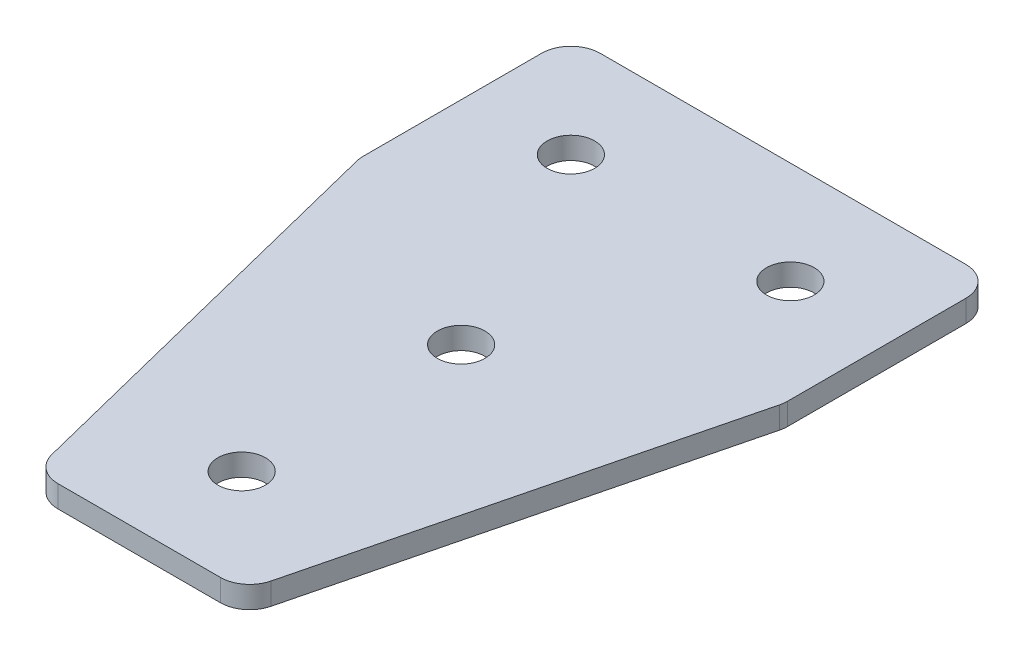
ISO-10303-21;
HEADER;
FILE_DESCRIPTION(('STEP AP214'),'2;1');
FILE_NAME('part.step','',(''),(''),'','','');
FILE_SCHEMA(('AUTOMOTIVE_DESIGN { 1 0 10303 214 1 1 1 1 }'));
ENDSEC;
DATA;
#1=APPLICATION_CONTEXT('core data for automotive mechanical design processes');
#2=APPLICATION_PROTOCOL_DEFINITION('international standard','automotive_design',2000,#1);
#3=PRODUCT_CONTEXT('',#1,'mechanical');
#4=PRODUCT('Part','Part','',(#3));
#5=PRODUCT_RELATED_PRODUCT_CATEGORY('part','',(#4));
#6=PRODUCT_DEFINITION_FORMATION('','',#4);
#7=PRODUCT_DEFINITION_CONTEXT('part definition',#1,'design');
#8=PRODUCT_DEFINITION('design','',#6,#7);
#9=PRODUCT_DEFINITION_SHAPE('','',#8);
#10=(LENGTH_UNIT() NAMED_UNIT(*) SI_UNIT(.MILLI.,.METRE.));
#11=(NAMED_UNIT(*) PLANE_ANGLE_UNIT() SI_UNIT($,.RADIAN.));
#12=(NAMED_UNIT(*) SI_UNIT($,.STERADIAN.) SOLID_ANGLE_UNIT());
#13=UNCERTAINTY_MEASURE_WITH_UNIT(LENGTH_MEASURE(1.E-05),#10,'distance_accuracy_value','');
#14=(GEOMETRIC_REPRESENTATION_CONTEXT(3) GLOBAL_UNCERTAINTY_ASSIGNED_CONTEXT((#13)) GLOBAL_UNIT_ASSIGNED_CONTEXT((#10,
#11,#12)) REPRESENTATION_CONTEXT('',''));
#15=CARTESIAN_POINT('',(0.,0.,0.));
#16=DIRECTION('',(0.,0.,1.));
#17=DIRECTION('',(1.,0.,0.));
#18=AXIS2_PLACEMENT_3D('',#15,#16,#17);
#19=CARTESIAN_POINT('',(-1.85772119630201,2.39126526069458,-16.2830335623448));
#20=DIRECTION('',(0.,-1.,0.));
#21=DIRECTION('',(0.,0.,-1.));
#22=AXIS2_PLACEMENT_3D('',#19,#20,#21);
#23=PLANE('',#22);
#24=CARTESIAN_POINT('',(-1.85772119630202,2.39126526069458,-1.2830335623448));
#25=DIRECTION('',(0.,1.,0.));
#26=DIRECTION('',(0.,0.,1.));
#27=AXIS2_PLACEMENT_3D('',#24,#25,#26);
#28=CIRCLE('',#27,1.625);
#29=CARTESIAN_POINT('',(-1.85772119630202,2.39126526069458,0.341966437655205));
#30=VERTEX_POINT('',#29);
#31=EDGE_CURVE('E147',#30,#30,#28,.T.);
#32=ORIENTED_EDGE('',*,*,#31,.T.);
#33=EDGE_LOOP('',(#32));
#34=FACE_BOUND('',#33,.T.);
#35=DIRECTION('',(1.,0.,0.));
#36=VECTOR('',#35,1.);
#37=CARTESIAN_POINT('',(-8.8577211963021,2.39126526069458,20.7169664376552));
#38=LINE('',#37,#36);
#39=CARTESIAN_POINT('',(-7.40578018029104,2.39126526069458,20.7169664376552));
#40=VERTEX_POINT('',#39);
#41=CARTESIAN_POINT('',(3.69033778768704,2.39126526069458,20.7169664376552));
#42=VERTEX_POINT('',#41);
#43=EDGE_CURVE('E158',#40,#42,#38,.T.);
#44=ORIENTED_EDGE('',*,*,#43,.F.);
#45=CARTESIAN_POINT('',(-7.40578018029105,2.39126526069458,18.7169664376552));
#46=DIRECTION('',(0.,1.,0.));
#47=DIRECTION('',(0.,0.,-1.));
#48=AXIS2_PLACEMENT_3D('',#45,#46,#47);
#49=CIRCLE('',#48,2.);
#50=CARTESIAN_POINT('',(-9.34606518058171,2.39126526069458,19.2020376877278));
#51=VERTEX_POINT('',#50);
#52=EDGE_CURVE('E215',#51,#40,#49,.T.);
#53=ORIENTED_EDGE('',*,*,#52,.F.);
#54=DIRECTION('',(-0.242535625036328,0.,-0.970142500145333));
#55=VECTOR('',#54,1.);
#56=CARTESIAN_POINT('',(-8.96733299309988,2.39126526069458,20.7169664376552));
#57=LINE('',#56,#55);
#58=CARTESIAN_POINT('',(-16.2980061965926,2.39126526069458,-8.60572637631624));
#59=VERTEX_POINT('',#58);
#60=EDGE_CURVE('E218',#51,#59,#57,.T.);
#61=ORIENTED_EDGE('',*,*,#60,.T.);
#62=CARTESIAN_POINT('',(-14.3577211963019,2.39126526069458,-9.09079762638889));
#63=DIRECTION('',(0.,1.,0.));
#64=DIRECTION('',(0.,0.,-1.));
#65=AXIS2_PLACEMENT_3D('',#62,#63,#64);
#66=CIRCLE('',#65,2.);
#67=CARTESIAN_POINT('',(-16.3577211963019,2.39126526069458,-9.09079762638889));
#68=VERTEX_POINT('',#67);
#69=EDGE_CURVE('E221',#68,#59,#66,.T.);
#70=ORIENTED_EDGE('',*,*,#69,.F.);
#71=DIRECTION('',(0.,0.,-1.));
#72=VECTOR('',#71,1.);
#73=CARTESIAN_POINT('',(-16.3577211963019,2.39126526069458,-8.84458637515358));
#74=LINE('',#73,#72);
#75=CARTESIAN_POINT('',(-16.3577211963019,2.39126526069458,-21.2830335623448));
#76=VERTEX_POINT('',#75);
#77=EDGE_CURVE('E130',#68,#76,#74,.T.);
#78=ORIENTED_EDGE('',*,*,#77,.T.);
#79=CARTESIAN_POINT('',(-14.3577211963019,2.39126526069458,-21.2830335623448));
#80=DIRECTION('',(0.,1.,0.));
#81=DIRECTION('',(0.,0.,-1.));
#82=AXIS2_PLACEMENT_3D('',#79,#80,#81);
#83=CIRCLE('',#82,2.);
#84=CARTESIAN_POINT('',(-14.3577211963019,2.39126526069458,-23.2830335623448));
#85=VERTEX_POINT('',#84);
#86=EDGE_CURVE('E227',#85,#76,#83,.T.);
#87=ORIENTED_EDGE('',*,*,#86,.F.);
#88=DIRECTION('',(-1.,0.,0.));
#89=VECTOR('',#88,1.);
#90=CARTESIAN_POINT('',(12.6422788036979,2.39126526069458,-23.2830335623448));
#91=LINE('',#90,#89);
#92=CARTESIAN_POINT('',(10.6422788036979,2.39126526069458,-23.2830335623448));
#93=VERTEX_POINT('',#92);
#94=EDGE_CURVE('E134',#93,#85,#91,.T.);
#95=ORIENTED_EDGE('',*,*,#94,.F.);
#96=CARTESIAN_POINT('',(10.6422788036979,2.39126526069458,-21.2830335623448));
#97=DIRECTION('',(0.,-1.,0.));
#98=DIRECTION('',(0.,0.,-1.));
#99=AXIS2_PLACEMENT_3D('',#96,#97,#98);
#100=CIRCLE('',#99,2.);
#101=CARTESIAN_POINT('',(12.6422788036979,2.39126526069458,-21.2830335623448));
#102=VERTEX_POINT('',#101);
#103=EDGE_CURVE('E179',#93,#102,#100,.T.);
#104=ORIENTED_EDGE('',*,*,#103,.T.);
#105=DIRECTION('',(0.,0.,-1.));
#106=VECTOR('',#105,1.);
#107=CARTESIAN_POINT('',(12.6422788036979,2.39126526069458,-8.84458637515358));
#108=LINE('',#107,#106);
#109=CARTESIAN_POINT('',(12.6422788036979,2.39126526069458,-9.09079762638889));
#110=VERTEX_POINT('',#109);
#111=EDGE_CURVE('E163',#110,#102,#108,.T.);
#112=ORIENTED_EDGE('',*,*,#111,.F.);
#113=CARTESIAN_POINT('',(10.6422788036979,2.39126526069458,-9.09079762638889));
#114=DIRECTION('',(0.,-1.,0.));
#115=DIRECTION('',(0.,0.,-1.));
#116=AXIS2_PLACEMENT_3D('',#113,#114,#115);
#117=CIRCLE('',#116,2.);
#118=CARTESIAN_POINT('',(12.5825638039886,2.39126526069458,-8.60572637631625));
#119=VERTEX_POINT('',#118);
#120=EDGE_CURVE('E31',#110,#119,#117,.T.);
#121=ORIENTED_EDGE('',*,*,#120,.T.);
#122=DIRECTION('',(0.242535625036328,0.,-0.970142500145333));
#123=VECTOR('',#122,1.);
#124=CARTESIAN_POINT('',(5.25189060049588,2.39126526069458,20.7169664376552));
#125=LINE('',#124,#123);
#126=CARTESIAN_POINT('',(5.6306227879777,2.39126526069458,19.2020376877278));
#127=VERTEX_POINT('',#126);
#128=EDGE_CURVE('E161',#127,#119,#125,.T.);
#129=ORIENTED_EDGE('',*,*,#128,.F.);
#130=CARTESIAN_POINT('',(3.69033778768704,2.39126526069458,18.7169664376552));
#131=DIRECTION('',(0.,-1.,0.));
#132=DIRECTION('',(0.,0.,-1.));
#133=AXIS2_PLACEMENT_3D('',#130,#131,#132);
#134=CIRCLE('',#133,2.);
#135=EDGE_CURVE('E182',#127,#42,#134,.T.);
#136=ORIENTED_EDGE('',*,*,#135,.T.);
#137=EDGE_LOOP('',(#44,#53,#61,#70,#78,#87,#95,#104,#112,#121,#129,#136));
#138=FACE_BOUND('',#137,.T.);
#139=CARTESIAN_POINT('',(-1.85772119630202,2.39126526069458,13.7169664376552));
#140=DIRECTION('',(0.,1.,0.));
#141=DIRECTION('',(0.,0.,1.));
#142=AXIS2_PLACEMENT_3D('',#139,#140,#141);
#143=CIRCLE('',#142,1.625);
#144=CARTESIAN_POINT('',(-1.85772119630202,2.39126526069458,15.3419664376552));
#145=VERTEX_POINT('',#144);
#146=EDGE_CURVE('E139',#145,#145,#143,.T.);
#147=ORIENTED_EDGE('',*,*,#146,.T.);
#148=EDGE_LOOP('',(#147));
#149=FACE_BOUND('',#148,.T.);
#150=CARTESIAN_POINT('',(5.64227880369799,2.39126526069458,-16.2830335623448));
#151=DIRECTION('',(0.,1.,0.));
#152=DIRECTION('',(0.,0.,1.));
#153=AXIS2_PLACEMENT_3D('',#150,#151,#152);
#154=CIRCLE('',#153,1.625);
#155=CARTESIAN_POINT('',(5.64227880369799,2.39126526069458,-14.6580335623448));
#156=VERTEX_POINT('',#155);
#157=EDGE_CURVE('E119',#156,#156,#154,.T.);
#158=ORIENTED_EDGE('',*,*,#157,.T.);
#159=EDGE_LOOP('',(#158));
#160=FACE_BOUND('',#159,.T.);
#161=CARTESIAN_POINT('',(-9.35772119630201,2.39126526069458,-16.2830335623448));
#162=DIRECTION('',(0.,-1.,0.));
#163=DIRECTION('',(0.,0.,1.));
#164=AXIS2_PLACEMENT_3D('',#161,#162,#163);
#165=CIRCLE('',#164,1.625);
#166=CARTESIAN_POINT('',(-9.35772119630201,2.39126526069458,-14.6580335623448));
#167=VERTEX_POINT('',#166);
#168=EDGE_CURVE('E248',#167,#167,#165,.T.);
#169=ORIENTED_EDGE('',*,*,#168,.F.);
#170=EDGE_LOOP('',(#169));
#171=FACE_BOUND('',#170,.T.);
#172=ADVANCED_FACE('F16',(#34,#138,#149,#160,#171),#23,.T.);
#173=CARTESIAN_POINT('',(12.6422788036979,2.39126526069458,-23.2830335623448));
#174=DIRECTION('',(0.,0.,-1.));
#175=DIRECTION('',(-1.,0.,0.));
#176=AXIS2_PLACEMENT_3D('',#173,#174,#175);
#177=PLANE('',#176);
#178=ORIENTED_EDGE('',*,*,#94,.T.);
#179=DIRECTION('',(0.,1.,0.));
#180=VECTOR('',#179,1.);
#181=CARTESIAN_POINT('',(-14.3577211963019,2.39126526069458,-23.2830335623448));
#182=LINE('',#181,#180);
#183=CARTESIAN_POINT('',(-14.3577211963019,3.89126526069458,-23.2830335623448));
#184=VERTEX_POINT('',#183);
#185=EDGE_CURVE('E125',#184,#85,#182,.F.);
#186=ORIENTED_EDGE('',*,*,#185,.F.);
#187=DIRECTION('',(-1.,0.,0.));
#188=VECTOR('',#187,1.);
#189=CARTESIAN_POINT('',(12.6422788036979,3.89126526069458,-23.2830335623448));
#190=LINE('',#189,#188);
#191=CARTESIAN_POINT('',(10.6422788036979,3.89126526069458,-23.2830335623448));
#192=VERTEX_POINT('',#191);
#193=EDGE_CURVE('E105',#192,#184,#190,.T.);
#194=ORIENTED_EDGE('',*,*,#193,.F.);
#195=DIRECTION('',(0.,1.,0.));
#196=VECTOR('',#195,1.);
#197=CARTESIAN_POINT('',(10.6422788036979,2.39126526069458,-23.2830335623448));
#198=LINE('',#197,#196);
#199=EDGE_CURVE('E10',#192,#93,#198,.F.);
#200=ORIENTED_EDGE('',*,*,#199,.T.);
#201=EDGE_LOOP('',(#178,#186,#194,#200));
#202=FACE_BOUND('',#201,.T.);
#203=ADVANCED_FACE('F132',(#202),#177,.T.);
#204=CARTESIAN_POINT('',(12.6422788036979,2.39126526069458,-8.84458637515358));
#205=DIRECTION('',(1.,0.,0.));
#206=DIRECTION('',(0.,0.,-1.));
#207=AXIS2_PLACEMENT_3D('',#204,#205,#206);
#208=PLANE('',#207);
#209=DIRECTION('',(0.,0.,-1.));
#210=VECTOR('',#209,1.);
#211=CARTESIAN_POINT('',(12.6422788036979,3.89126526069458,-8.84458637515358));
#212=LINE('',#211,#210);
#213=CARTESIAN_POINT('',(12.6422788036979,3.89126526069458,-9.09079762638889));
#214=VERTEX_POINT('',#213);
#215=CARTESIAN_POINT('',(12.6422788036979,3.89126526069458,-21.2830335623448));
#216=VERTEX_POINT('',#215);
#217=EDGE_CURVE('E159',#214,#216,#212,.T.);
#218=ORIENTED_EDGE('',*,*,#217,.F.);
#219=DIRECTION('',(0.,1.,0.));
#220=VECTOR('',#219,1.);
#221=CARTESIAN_POINT('',(12.6422788036979,2.39126526069458,-9.09079762638889));
#222=LINE('',#221,#220);
#223=EDGE_CURVE('E24',#214,#110,#222,.F.);
#224=ORIENTED_EDGE('',*,*,#223,.T.);
#225=ORIENTED_EDGE('',*,*,#111,.T.);
#226=DIRECTION('',(0.,1.,0.));
#227=VECTOR('',#226,1.);
#228=CARTESIAN_POINT('',(12.6422788036979,2.39126526069458,-21.2830335623448));
#229=LINE('',#228,#227);
#230=EDGE_CURVE('E189',#102,#216,#229,.T.);
#231=ORIENTED_EDGE('',*,*,#230,.T.);
#232=EDGE_LOOP('',(#218,#224,#225,#231));
#233=FACE_BOUND('',#232,.T.);
#234=ADVANCED_FACE('F194',(#233),#208,.T.);
#235=CARTESIAN_POINT('',(5.25189060049588,2.39126526069458,20.7169664376552));
#236=DIRECTION('',(0.970142500145333,0.,0.242535625036328));
#237=DIRECTION('',(0.242535625036328,0.,-0.970142500145333));
#238=AXIS2_PLACEMENT_3D('',#235,#236,#237);
#239=PLANE('',#238);
#240=DIRECTION('',(0.242535625036328,0.,-0.970142500145333));
#241=VECTOR('',#240,1.);
#242=CARTESIAN_POINT('',(5.25189060049588,3.89126526069458,20.7169664376552));
#243=LINE('',#242,#241);
#244=CARTESIAN_POINT('',(5.6306227879777,3.89126526069458,19.2020376877278));
#245=VERTEX_POINT('',#244);
#246=CARTESIAN_POINT('',(12.5825638039886,3.89126526069458,-8.60572637631625));
#247=VERTEX_POINT('',#246);
#248=EDGE_CURVE('E167',#245,#247,#243,.T.);
#249=ORIENTED_EDGE('',*,*,#248,.F.);
#250=DIRECTION('',(0.,1.,0.));
#251=VECTOR('',#250,1.);
#252=CARTESIAN_POINT('',(5.6306227879777,2.39126526069458,19.2020376877278));
#253=LINE('',#252,#251);
#254=EDGE_CURVE('E38',#245,#127,#253,.F.);
#255=ORIENTED_EDGE('',*,*,#254,.T.);
#256=ORIENTED_EDGE('',*,*,#128,.T.);
#257=DIRECTION('',(0.,1.,0.));
#258=VECTOR('',#257,1.);
#259=CARTESIAN_POINT('',(12.5825638039886,2.39126526069458,-8.60572637631624));
#260=LINE('',#259,#258);
#261=EDGE_CURVE('E185',#119,#247,#260,.T.);
#262=ORIENTED_EDGE('',*,*,#261,.T.);
#263=EDGE_LOOP('',(#249,#255,#256,#262));
#264=FACE_BOUND('',#263,.T.);
#265=ADVANCED_FACE('F201',(#264),#239,.T.);
#266=CARTESIAN_POINT('',(-8.8577211963021,2.39126526069458,20.7169664376552));
#267=DIRECTION('',(0.,0.,1.));
#268=DIRECTION('',(1.,0.,0.));
#269=AXIS2_PLACEMENT_3D('',#266,#267,#268);
#270=PLANE('',#269);
#271=DIRECTION('',(1.,0.,0.));
#272=VECTOR('',#271,1.);
#273=CARTESIAN_POINT('',(-8.8577211963021,3.89126526069458,20.7169664376552));
#274=LINE('',#273,#272);
#275=CARTESIAN_POINT('',(-7.40578018029104,3.89126526069458,20.7169664376552));
#276=VERTEX_POINT('',#275);
#277=CARTESIAN_POINT('',(3.69033778768704,3.89126526069458,20.7169664376552));
#278=VERTEX_POINT('',#277);
#279=EDGE_CURVE('E118',#276,#278,#274,.T.);
#280=ORIENTED_EDGE('',*,*,#279,.F.);
#281=DIRECTION('',(0.,1.,0.));
#282=VECTOR('',#281,1.);
#283=CARTESIAN_POINT('',(-7.40578018029104,2.39126526069458,20.7169664376552));
#284=LINE('',#283,#282);
#285=EDGE_CURVE('E211',#40,#276,#284,.T.);
#286=ORIENTED_EDGE('',*,*,#285,.F.);
#287=ORIENTED_EDGE('',*,*,#43,.T.);
#288=DIRECTION('',(0.,1.,0.));
#289=VECTOR('',#288,1.);
#290=CARTESIAN_POINT('',(3.69033778768704,2.39126526069458,20.7169664376552));
#291=LINE('',#290,#289);
#292=EDGE_CURVE('E176',#42,#278,#291,.T.);
#293=ORIENTED_EDGE('',*,*,#292,.T.);
#294=EDGE_LOOP('',(#280,#286,#287,#293));
#295=FACE_BOUND('',#294,.T.);
#296=ADVANCED_FACE('F208',(#295),#270,.T.);
#297=CARTESIAN_POINT('',(-1.85772119630201,3.89126526069458,-16.2830335623448));
#298=DIRECTION('',(0.,-1.,0.));
#299=DIRECTION('',(0.,0.,-1.));
#300=AXIS2_PLACEMENT_3D('',#297,#298,#299);
#301=PLANE('',#300);
#302=CARTESIAN_POINT('',(-1.85772119630202,3.89126526069458,-1.2830335623448));
#303=DIRECTION('',(0.,1.,0.));
#304=DIRECTION('',(0.,0.,1.));
#305=AXIS2_PLACEMENT_3D('',#302,#303,#304);
#306=CIRCLE('',#305,1.625);
#307=CARTESIAN_POINT('',(-1.85772119630202,3.89126526069458,0.341966437655205));
#308=VERTEX_POINT('',#307);
#309=EDGE_CURVE('E145',#308,#308,#306,.T.);
#310=ORIENTED_EDGE('',*,*,#309,.F.);
#311=EDGE_LOOP('',(#310));
#312=FACE_BOUND('',#311,.T.);
#313=CARTESIAN_POINT('',(-7.40578018029105,3.89126526069458,18.7169664376552));
#314=DIRECTION('',(0.,1.,0.));
#315=DIRECTION('',(0.,0.,-1.));
#316=AXIS2_PLACEMENT_3D('',#313,#314,#315);
#317=CIRCLE('',#316,2.);
#318=CARTESIAN_POINT('',(-9.34606518058171,3.89126526069458,19.2020376877278));
#319=VERTEX_POINT('',#318);
#320=EDGE_CURVE('E233',#276,#319,#317,.F.);
#321=ORIENTED_EDGE('',*,*,#320,.F.);
#322=ORIENTED_EDGE('',*,*,#279,.T.);
#323=CARTESIAN_POINT('',(3.69033778768704,3.89126526069458,18.7169664376552));
#324=DIRECTION('',(0.,-1.,0.));
#325=DIRECTION('',(0.,0.,-1.));
#326=AXIS2_PLACEMENT_3D('',#323,#324,#325);
#327=CIRCLE('',#326,2.);
#328=EDGE_CURVE('E174',#278,#245,#327,.F.);
#329=ORIENTED_EDGE('',*,*,#328,.T.);
#330=ORIENTED_EDGE('',*,*,#248,.T.);
#331=CARTESIAN_POINT('',(10.6422788036979,3.89126526069458,-9.09079762638889));
#332=DIRECTION('',(0.,-1.,0.));
#333=DIRECTION('',(0.,0.,-1.));
#334=AXIS2_PLACEMENT_3D('',#331,#332,#333);
#335=CIRCLE('',#334,2.);
#336=EDGE_CURVE('E172',#247,#214,#335,.F.);
#337=ORIENTED_EDGE('',*,*,#336,.T.);
#338=ORIENTED_EDGE('',*,*,#217,.T.);
#339=CARTESIAN_POINT('',(10.6422788036979,3.89126526069458,-21.2830335623448));
#340=DIRECTION('',(0.,-1.,0.));
#341=DIRECTION('',(0.,0.,-1.));
#342=AXIS2_PLACEMENT_3D('',#339,#340,#341);
#343=CIRCLE('',#342,2.);
#344=EDGE_CURVE('E114',#216,#192,#343,.F.);
#345=ORIENTED_EDGE('',*,*,#344,.T.);
#346=ORIENTED_EDGE('',*,*,#193,.T.);
#347=CARTESIAN_POINT('',(-14.3577211963019,3.89126526069458,-21.2830335623448));
#348=DIRECTION('',(0.,1.,0.));
#349=DIRECTION('',(0.,0.,-1.));
#350=AXIS2_PLACEMENT_3D('',#347,#348,#349);
#351=CIRCLE('',#350,2.);
#352=CARTESIAN_POINT('',(-16.3577211963019,3.89126526069458,-21.2830335623448));
#353=VERTEX_POINT('',#352);
#354=EDGE_CURVE('E111',#353,#184,#351,.F.);
#355=ORIENTED_EDGE('',*,*,#354,.F.);
#356=DIRECTION('',(0.,0.,-1.));
#357=VECTOR('',#356,1.);
#358=CARTESIAN_POINT('',(-16.3577211963019,3.89126526069458,-8.84458637515358));
#359=LINE('',#358,#357);
#360=CARTESIAN_POINT('',(-16.3577211963019,3.89126526069458,-9.09079762638889));
#361=VERTEX_POINT('',#360);
#362=EDGE_CURVE('E238',#361,#353,#359,.T.);
#363=ORIENTED_EDGE('',*,*,#362,.F.);
#364=CARTESIAN_POINT('',(-14.3577211963019,3.89126526069458,-9.09079762638889));
#365=DIRECTION('',(0.,1.,0.));
#366=DIRECTION('',(0.,0.,-1.));
#367=AXIS2_PLACEMENT_3D('',#364,#365,#366);
#368=CIRCLE('',#367,2.);
#369=CARTESIAN_POINT('',(-16.2980061965926,3.89126526069458,-8.60572637631624));
#370=VERTEX_POINT('',#369);
#371=EDGE_CURVE('E129',#370,#361,#368,.F.);
#372=ORIENTED_EDGE('',*,*,#371,.F.);
#373=DIRECTION('',(-0.242535625036328,0.,-0.970142500145333));
#374=VECTOR('',#373,1.);
#375=CARTESIAN_POINT('',(-8.96733299309988,3.89126526069458,20.7169664376552));
#376=LINE('',#375,#374);
#377=EDGE_CURVE('E242',#319,#370,#376,.T.);
#378=ORIENTED_EDGE('',*,*,#377,.F.);
#379=EDGE_LOOP('',(#321,#322,#329,#330,#337,#338,#345,#346,#355,#363,#372,#378));
#380=FACE_BOUND('',#379,.T.);
#381=CARTESIAN_POINT('',(-1.85772119630202,3.89126526069458,13.7169664376552));
#382=DIRECTION('',(0.,1.,0.));
#383=DIRECTION('',(0.,0.,1.));
#384=AXIS2_PLACEMENT_3D('',#381,#382,#383);
#385=CIRCLE('',#384,1.625);
#386=CARTESIAN_POINT('',(-1.85772119630202,3.89126526069458,15.3419664376552));
#387=VERTEX_POINT('',#386);
#388=EDGE_CURVE('E135',#387,#387,#385,.T.);
#389=ORIENTED_EDGE('',*,*,#388,.F.);
#390=EDGE_LOOP('',(#389));
#391=FACE_BOUND('',#390,.T.);
#392=CARTESIAN_POINT('',(5.64227880369799,3.89126526069458,-16.2830335623448));
#393=DIRECTION('',(0.,1.,0.));
#394=DIRECTION('',(0.,0.,1.));
#395=AXIS2_PLACEMENT_3D('',#392,#393,#394);
#396=CIRCLE('',#395,1.625);
#397=CARTESIAN_POINT('',(5.64227880369799,3.89126526069458,-14.6580335623448));
#398=VERTEX_POINT('',#397);
#399=EDGE_CURVE('E150',#398,#398,#396,.T.);
#400=ORIENTED_EDGE('',*,*,#399,.F.);
#401=EDGE_LOOP('',(#400));
#402=FACE_BOUND('',#401,.T.);
#403=CARTESIAN_POINT('',(-9.35772119630201,3.89126526069458,-16.2830335623448));
#404=DIRECTION('',(0.,-1.,0.));
#405=DIRECTION('',(0.,0.,1.));
#406=AXIS2_PLACEMENT_3D('',#403,#404,#405);
#407=CIRCLE('',#406,1.625);
#408=CARTESIAN_POINT('',(-9.35772119630201,3.89126526069458,-14.6580335623448));
#409=VERTEX_POINT('',#408);
#410=EDGE_CURVE('E245',#409,#409,#407,.T.);
#411=ORIENTED_EDGE('',*,*,#410,.T.);
#412=EDGE_LOOP('',(#411));
#413=FACE_BOUND('',#412,.T.);
#414=ADVANCED_FACE('F108',(#312,#380,#391,#402,#413),#301,.F.);
#415=CARTESIAN_POINT('',(3.69033778768704,2.39126526069458,18.7169664376552));
#416=DIRECTION('',(0.,1.,0.));
#417=DIRECTION('',(0.,0.,1.));
#418=AXIS2_PLACEMENT_3D('',#415,#416,#417);
#419=CYLINDRICAL_SURFACE('',#418,2.);
#420=ORIENTED_EDGE('',*,*,#135,.F.);
#421=ORIENTED_EDGE('',*,*,#254,.F.);
#422=ORIENTED_EDGE('',*,*,#328,.F.);
#423=ORIENTED_EDGE('',*,*,#292,.F.);
#424=EDGE_LOOP('',(#420,#421,#422,#423));
#425=FACE_BOUND('',#424,.T.);
#426=ADVANCED_FACE('F206',(#425),#419,.T.);
#427=CARTESIAN_POINT('',(10.6422788036979,2.39126526069458,-9.09079762638889));
#428=DIRECTION('',(0.,1.,0.));
#429=DIRECTION('',(0.,0.,1.));
#430=AXIS2_PLACEMENT_3D('',#427,#428,#429);
#431=CYLINDRICAL_SURFACE('',#430,2.);
#432=ORIENTED_EDGE('',*,*,#120,.F.);
#433=ORIENTED_EDGE('',*,*,#223,.F.);
#434=ORIENTED_EDGE('',*,*,#336,.F.);
#435=ORIENTED_EDGE('',*,*,#261,.F.);
#436=EDGE_LOOP('',(#432,#433,#434,#435));
#437=FACE_BOUND('',#436,.T.);
#438=ADVANCED_FACE('F200',(#437),#431,.T.);
#439=CARTESIAN_POINT('',(10.6422788036979,2.39126526069458,-21.2830335623448));
#440=DIRECTION('',(0.,1.,0.));
#441=DIRECTION('',(0.,0.,1.));
#442=AXIS2_PLACEMENT_3D('',#439,#440,#441);
#443=CYLINDRICAL_SURFACE('',#442,2.);
#444=ORIENTED_EDGE('',*,*,#103,.F.);
#445=ORIENTED_EDGE('',*,*,#199,.F.);
#446=ORIENTED_EDGE('',*,*,#344,.F.);
#447=ORIENTED_EDGE('',*,*,#230,.F.);
#448=EDGE_LOOP('',(#444,#445,#446,#447));
#449=FACE_BOUND('',#448,.T.);
#450=ADVANCED_FACE('F18',(#449),#443,.T.);
#451=CARTESIAN_POINT('',(5.64227880369799,2.39126526069458,-16.2830335623448));
#452=DIRECTION('',(0.,1.,0.));
#453=DIRECTION('',(0.,0.,1.));
#454=AXIS2_PLACEMENT_3D('',#451,#452,#453);
#455=CYLINDRICAL_SURFACE('',#454,1.625);
#456=ORIENTED_EDGE('',*,*,#157,.F.);
#457=EDGE_LOOP('',(#456));
#458=FACE_BOUND('',#457,.T.);
#459=ORIENTED_EDGE('',*,*,#399,.T.);
#460=EDGE_LOOP('',(#459));
#461=FACE_BOUND('',#460,.T.);
#462=ADVANCED_FACE('F282',(#458,#461),#455,.F.);
#463=CARTESIAN_POINT('',(-1.85772119630202,2.39126526069458,-1.2830335623448));
#464=DIRECTION('',(0.,1.,0.));
#465=DIRECTION('',(0.,0.,1.));
#466=AXIS2_PLACEMENT_3D('',#463,#464,#465);
#467=CYLINDRICAL_SURFACE('',#466,1.625);
#468=ORIENTED_EDGE('',*,*,#31,.F.);
#469=EDGE_LOOP('',(#468));
#470=FACE_BOUND('',#469,.T.);
#471=ORIENTED_EDGE('',*,*,#309,.T.);
#472=EDGE_LOOP('',(#471));
#473=FACE_BOUND('',#472,.T.);
#474=ADVANCED_FACE('F287',(#470,#473),#467,.F.);
#475=CARTESIAN_POINT('',(-1.85772119630202,2.39126526069458,13.7169664376552));
#476=DIRECTION('',(0.,1.,0.));
#477=DIRECTION('',(0.,0.,1.));
#478=AXIS2_PLACEMENT_3D('',#475,#476,#477);
#479=CYLINDRICAL_SURFACE('',#478,1.625);
#480=ORIENTED_EDGE('',*,*,#388,.T.);
#481=EDGE_LOOP('',(#480));
#482=FACE_BOUND('',#481,.T.);
#483=ORIENTED_EDGE('',*,*,#146,.F.);
#484=EDGE_LOOP('',(#483));
#485=FACE_BOUND('',#484,.T.);
#486=ADVANCED_FACE('F293',(#482,#485),#479,.F.);
#487=CARTESIAN_POINT('',(-16.3577211963019,2.39126526069458,-8.84458637515358));
#488=DIRECTION('',(-1.,0.,0.));
#489=DIRECTION('',(0.,0.,-1.));
#490=AXIS2_PLACEMENT_3D('',#487,#488,#489);
#491=PLANE('',#490);
#492=ORIENTED_EDGE('',*,*,#362,.T.);
#493=DIRECTION('',(0.,1.,0.));
#494=VECTOR('',#493,1.);
#495=CARTESIAN_POINT('',(-16.3577211963019,2.39126526069458,-21.2830335623448));
#496=LINE('',#495,#494);
#497=EDGE_CURVE('E127',#76,#353,#496,.T.);
#498=ORIENTED_EDGE('',*,*,#497,.F.);
#499=ORIENTED_EDGE('',*,*,#77,.F.);
#500=DIRECTION('',(0.,1.,0.));
#501=VECTOR('',#500,1.);
#502=CARTESIAN_POINT('',(-16.3577211963019,2.39126526069458,-9.09079762638889));
#503=LINE('',#502,#501);
#504=EDGE_CURVE('E136',#361,#68,#503,.F.);
#505=ORIENTED_EDGE('',*,*,#504,.F.);
#506=EDGE_LOOP('',(#492,#498,#499,#505));
#507=FACE_BOUND('',#506,.T.);
#508=ADVANCED_FACE('F255',(#507),#491,.T.);
#509=CARTESIAN_POINT('',(-8.96733299309988,2.39126526069458,20.7169664376552));
#510=DIRECTION('',(-0.970142500145333,0.,0.242535625036328));
#511=DIRECTION('',(-0.242535625036328,0.,-0.970142500145333));
#512=AXIS2_PLACEMENT_3D('',#509,#510,#511);
#513=PLANE('',#512);
#514=ORIENTED_EDGE('',*,*,#377,.T.);
#515=DIRECTION('',(0.,1.,0.));
#516=VECTOR('',#515,1.);
#517=CARTESIAN_POINT('',(-16.2980061965926,2.39126526069458,-8.60572637631624));
#518=LINE('',#517,#516);
#519=EDGE_CURVE('E220',#59,#370,#518,.T.);
#520=ORIENTED_EDGE('',*,*,#519,.F.);
#521=ORIENTED_EDGE('',*,*,#60,.F.);
#522=DIRECTION('',(0.,1.,0.));
#523=VECTOR('',#522,1.);
#524=CARTESIAN_POINT('',(-9.34606518058171,2.39126526069458,19.2020376877278));
#525=LINE('',#524,#523);
#526=EDGE_CURVE('E224',#319,#51,#525,.F.);
#527=ORIENTED_EDGE('',*,*,#526,.F.);
#528=EDGE_LOOP('',(#514,#520,#521,#527));
#529=FACE_BOUND('',#528,.T.);
#530=ADVANCED_FACE('F237',(#529),#513,.T.);
#531=CARTESIAN_POINT('',(-7.40578018029105,2.39126526069458,18.7169664376552));
#532=DIRECTION('',(0.,1.,0.));
#533=DIRECTION('',(0.,0.,1.));
#534=AXIS2_PLACEMENT_3D('',#531,#532,#533);
#535=CYLINDRICAL_SURFACE('',#534,2.);
#536=ORIENTED_EDGE('',*,*,#52,.T.);
#537=ORIENTED_EDGE('',*,*,#285,.T.);
#538=ORIENTED_EDGE('',*,*,#320,.T.);
#539=ORIENTED_EDGE('',*,*,#526,.T.);
#540=EDGE_LOOP('',(#536,#537,#538,#539));
#541=FACE_BOUND('',#540,.T.);
#542=ADVANCED_FACE('F232',(#541),#535,.T.);
#543=CARTESIAN_POINT('',(-14.3577211963019,2.39126526069458,-9.09079762638889));
#544=DIRECTION('',(0.,1.,0.));
#545=DIRECTION('',(0.,0.,1.));
#546=AXIS2_PLACEMENT_3D('',#543,#544,#545);
#547=CYLINDRICAL_SURFACE('',#546,2.);
#548=ORIENTED_EDGE('',*,*,#69,.T.);
#549=ORIENTED_EDGE('',*,*,#519,.T.);
#550=ORIENTED_EDGE('',*,*,#371,.T.);
#551=ORIENTED_EDGE('',*,*,#504,.T.);
#552=EDGE_LOOP('',(#548,#549,#550,#551));
#553=FACE_BOUND('',#552,.T.);
#554=ADVANCED_FACE('F257',(#553),#547,.T.);
#555=CARTESIAN_POINT('',(-14.3577211963019,2.39126526069458,-21.2830335623448));
#556=DIRECTION('',(0.,1.,0.));
#557=DIRECTION('',(0.,0.,1.));
#558=AXIS2_PLACEMENT_3D('',#555,#556,#557);
#559=CYLINDRICAL_SURFACE('',#558,2.);
#560=ORIENTED_EDGE('',*,*,#86,.T.);
#561=ORIENTED_EDGE('',*,*,#497,.T.);
#562=ORIENTED_EDGE('',*,*,#354,.T.);
#563=ORIENTED_EDGE('',*,*,#185,.T.);
#564=EDGE_LOOP('',(#560,#561,#562,#563));
#565=FACE_BOUND('',#564,.T.);
#566=ADVANCED_FACE('F124',(#565),#559,.T.);
#567=CARTESIAN_POINT('',(-9.35772119630201,2.39126526069458,-16.2830335623448));
#568=DIRECTION('',(0.,1.,0.));
#569=DIRECTION('',(0.,0.,1.));
#570=AXIS2_PLACEMENT_3D('',#567,#568,#569);
#571=CYLINDRICAL_SURFACE('',#570,1.625);
#572=ORIENTED_EDGE('',*,*,#168,.T.);
#573=EDGE_LOOP('',(#572));
#574=FACE_BOUND('',#573,.T.);
#575=ORIENTED_EDGE('',*,*,#410,.F.);
#576=EDGE_LOOP('',(#575));
#577=FACE_BOUND('',#576,.T.);
#578=ADVANCED_FACE('F265',(#574,#577),#571,.F.);
#579=CLOSED_SHELL('',(#172,#203,#234,#265,#296,#414,#426,#438,#450,#462,#474,#486,#508,#530,
#542,#554,#566,#578));
#580=MANIFOLD_SOLID_BREP('B1',#579);
#581=ADVANCED_BREP_SHAPE_REPRESENTATION('',(#18,#580),#14);
#582=SHAPE_DEFINITION_REPRESENTATION(#9,#581);
ENDSEC;
END-ISO-10303-21;
